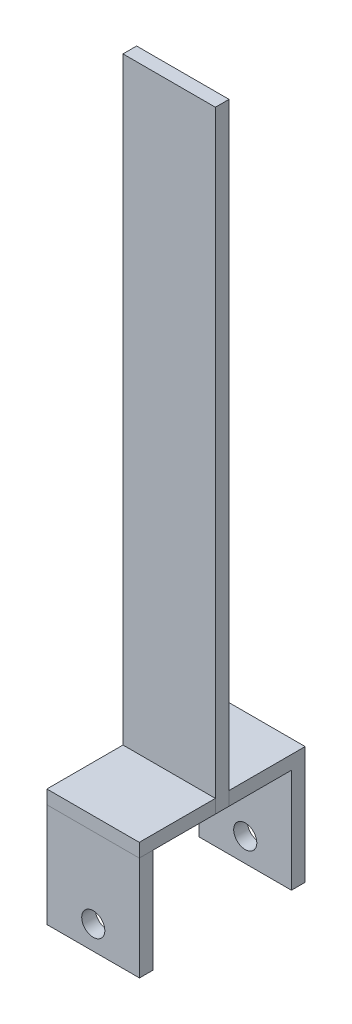
ISO-10303-21;
HEADER;
FILE_DESCRIPTION(('STEP AP214'),'2;1');
FILE_NAME('part.step','',(''),(''),'','','');
FILE_SCHEMA(('AUTOMOTIVE_DESIGN { 1 0 10303 214 1 1 1 1 }'));
ENDSEC;
DATA;
#1=APPLICATION_CONTEXT('core data for automotive mechanical design processes');
#2=APPLICATION_PROTOCOL_DEFINITION('international standard','automotive_design',2000,#1);
#3=PRODUCT_CONTEXT('',#1,'mechanical');
#4=PRODUCT('Part','Part','',(#3));
#5=PRODUCT_RELATED_PRODUCT_CATEGORY('part','',(#4));
#6=PRODUCT_DEFINITION_FORMATION('','',#4);
#7=PRODUCT_DEFINITION_CONTEXT('part definition',#1,'design');
#8=PRODUCT_DEFINITION('design','',#6,#7);
#9=PRODUCT_DEFINITION_SHAPE('','',#8);
#10=(LENGTH_UNIT() NAMED_UNIT(*) SI_UNIT(.MILLI.,.METRE.));
#11=(NAMED_UNIT(*) PLANE_ANGLE_UNIT() SI_UNIT($,.RADIAN.));
#12=(NAMED_UNIT(*) SI_UNIT($,.STERADIAN.) SOLID_ANGLE_UNIT());
#13=UNCERTAINTY_MEASURE_WITH_UNIT(LENGTH_MEASURE(1.E-05),#10,'distance_accuracy_value','');
#14=(GEOMETRIC_REPRESENTATION_CONTEXT(3) GLOBAL_UNCERTAINTY_ASSIGNED_CONTEXT((#13)) GLOBAL_UNIT_ASSIGNED_CONTEXT((#10,
#11,#12)) REPRESENTATION_CONTEXT('',''));
#15=CARTESIAN_POINT('',(0.,0.,0.));
#16=DIRECTION('',(0.,0.,1.));
#17=DIRECTION('',(1.,0.,0.));
#18=AXIS2_PLACEMENT_3D('',#15,#16,#17);
#19=CARTESIAN_POINT('',(8.48107175925922,-67.31,2.999994));
#20=DIRECTION('',(0.,1.,0.));
#21=DIRECTION('',(0.,0.,1.));
#22=AXIS2_PLACEMENT_3D('',#19,#20,#21);
#23=PLANE('',#22);
#24=DIRECTION('',(1.,0.,0.));
#25=VECTOR('',#24,1.);
#26=CARTESIAN_POINT('',(-11.8366059287919,-67.31,16.6772484590779));
#27=LINE('',#26,#25);
#28=CARTESIAN_POINT('',(-11.8366059287919,-67.31,16.6772484590779));
#29=VERTEX_POINT('',#28);
#30=CARTESIAN_POINT('',(8.48064584867505,-67.31,16.6772484590778));
#31=VERTEX_POINT('',#30);
#32=EDGE_CURVE('E48',#29,#31,#27,.T.);
#33=ORIENTED_EDGE('',*,*,#32,.F.);
#34=DIRECTION('',(0.000139125287994658,0.,-0.999999990322077));
#35=VECTOR('',#34,1.);
#36=CARTESIAN_POINT('',(-11.8370253887568,-67.31,19.6922284590778));
#37=LINE('',#36,#35);
#38=CARTESIAN_POINT('',(-11.8370253887568,-67.31,19.6922284590778));
#39=VERTEX_POINT('',#38);
#40=EDGE_CURVE('E165',#39,#29,#37,.T.);
#41=ORIENTED_EDGE('',*,*,#40,.F.);
#42=DIRECTION('',(-1.,0.,0.));
#43=VECTOR('',#42,1.);
#44=CARTESIAN_POINT('',(8.4810653086399,-67.31,19.6922284590778));
#45=LINE('',#44,#43);
#46=CARTESIAN_POINT('',(8.4810653086399,-67.31,19.6922284590778));
#47=VERTEX_POINT('',#46);
#48=EDGE_CURVE('E293',#47,#39,#45,.T.);
#49=ORIENTED_EDGE('',*,*,#48,.F.);
#50=DIRECTION('',(-0.000139125287993163,0.,-0.999999990322077));
#51=VECTOR('',#50,1.);
#52=CARTESIAN_POINT('',(8.47874299669106,-67.31,2.999994));
#53=LINE('',#52,#51);
#54=CARTESIAN_POINT('',(8.4810717592592,-67.31,19.738594));
#55=VERTEX_POINT('',#54);
#56=EDGE_CURVE('E209',#55,#47,#53,.T.);
#57=ORIENTED_EDGE('',*,*,#56,.F.);
#58=DIRECTION('',(1.,0.,0.));
#59=VECTOR('',#58,1.);
#60=CARTESIAN_POINT('',(8.4810717592592,-67.31,19.738594));
#61=LINE('',#60,#59);
#62=CARTESIAN_POINT('',(-11.8389282407408,-67.31,19.738594));
#63=VERTEX_POINT('',#62);
#64=EDGE_CURVE('E192',#63,#55,#61,.T.);
#65=ORIENTED_EDGE('',*,*,#64,.F.);
#66=DIRECTION('',(0.,0.,-1.));
#67=VECTOR('',#66,1.);
#68=CARTESIAN_POINT('',(-11.8389282407408,-67.31,2.999994));
#69=LINE('',#68,#67);
#70=CARTESIAN_POINT('',(-11.8389282407408,-67.31,-13.72362));
#71=VERTEX_POINT('',#70);
#72=EDGE_CURVE('E240',#63,#71,#69,.T.);
#73=ORIENTED_EDGE('',*,*,#72,.T.);
#74=DIRECTION('',(-1.,0.,0.));
#75=VECTOR('',#74,1.);
#76=CARTESIAN_POINT('',(-11.8389282407408,-67.31,-13.72362));
#77=LINE('',#76,#75);
#78=CARTESIAN_POINT('',(8.47916245665591,-67.31,-13.72362));
#79=VERTEX_POINT('',#78);
#80=EDGE_CURVE('E56',#79,#71,#77,.T.);
#81=ORIENTED_EDGE('',*,*,#80,.F.);
#82=DIRECTION('',(-0.000139125287993163,0.,-0.999999990322077));
#83=VECTOR('',#82,1.);
#84=CARTESIAN_POINT('',(8.47874299669106,-67.31,-16.7386));
#85=LINE('',#84,#83);
#86=CARTESIAN_POINT('',(8.48107175925922,-67.31,0.));
#87=VERTEX_POINT('',#86);
#88=EDGE_CURVE('E212',#87,#79,#85,.T.);
#89=ORIENTED_EDGE('',*,*,#88,.F.);
#90=DIRECTION('',(0.,0.,-1.));
#91=VECTOR('',#90,1.);
#92=CARTESIAN_POINT('',(8.48107175925922,-67.31,2.999994));
#93=LINE('',#92,#91);
#94=CARTESIAN_POINT('',(8.48107175925922,-67.31,2.999994));
#95=VERTEX_POINT('',#94);
#96=EDGE_CURVE('E41',#95,#87,#93,.T.);
#97=ORIENTED_EDGE('',*,*,#96,.F.);
#98=DIRECTION('',(1.,0.,0.));
#99=VECTOR('',#98,1.);
#100=CARTESIAN_POINT('',(8.48107175925922,-67.31,2.999994));
#101=LINE('',#100,#99);
#102=CARTESIAN_POINT('',(8.47874299669106,-67.31,2.999994));
#103=VERTEX_POINT('',#102);
#104=EDGE_CURVE('E231',#103,#95,#101,.T.);
#105=ORIENTED_EDGE('',*,*,#104,.F.);
#106=EDGE_CURVE('E208',#31,#103,#53,.T.);
#107=ORIENTED_EDGE('',*,*,#106,.F.);
#108=EDGE_LOOP('',(#33,#41,#49,#57,#65,#73,#81,#89,#97,#105,#107));
#109=FACE_BOUND('',#108,.T.);
#110=ADVANCED_FACE('F33',(#109),#23,.F.);
#111=CARTESIAN_POINT('',(0.,0.,2.999994));
#112=DIRECTION('',(0.,0.,-1.));
#113=DIRECTION('',(-1.,0.,0.));
#114=AXIS2_PLACEMENT_3D('',#111,#112,#113);
#115=PLANE('',#114);
#116=DIRECTION('',(0.,-1.,0.));
#117=VECTOR('',#116,1.);
#118=CARTESIAN_POINT('',(8.47874299669106,-64.310006,2.999994));
#119=LINE('',#118,#117);
#120=CARTESIAN_POINT('',(8.47874299669106,-64.310006,2.999994));
#121=VERTEX_POINT('',#120);
#122=EDGE_CURVE('E218',#121,#103,#119,.T.);
#123=ORIENTED_EDGE('',*,*,#122,.T.);
#124=ORIENTED_EDGE('',*,*,#104,.T.);
#125=DIRECTION('',(0.,1.,0.));
#126=VECTOR('',#125,1.);
#127=CARTESIAN_POINT('',(8.4810717592592,67.31,2.999994));
#128=LINE('',#127,#126);
#129=CARTESIAN_POINT('',(8.4810717592592,67.31,2.999994));
#130=VERTEX_POINT('',#129);
#131=EDGE_CURVE('E233',#95,#130,#128,.T.);
#132=ORIENTED_EDGE('',*,*,#131,.T.);
#133=DIRECTION('',(-1.,0.,0.));
#134=VECTOR('',#133,1.);
#135=CARTESIAN_POINT('',(-11.8389282407408,67.31,2.999994));
#136=LINE('',#135,#134);
#137=CARTESIAN_POINT('',(-11.8389282407408,67.31,2.999994));
#138=VERTEX_POINT('',#137);
#139=EDGE_CURVE('E236',#130,#138,#136,.T.);
#140=ORIENTED_EDGE('',*,*,#139,.T.);
#141=DIRECTION('',(0.,-1.,0.));
#142=VECTOR('',#141,1.);
#143=CARTESIAN_POINT('',(-11.8389282407408,-67.31,2.999994));
#144=LINE('',#143,#142);
#145=CARTESIAN_POINT('',(-11.8389282407408,-64.310006,2.999994));
#146=VERTEX_POINT('',#145);
#147=EDGE_CURVE('E238',#138,#146,#144,.T.);
#148=ORIENTED_EDGE('',*,*,#147,.T.);
#149=DIRECTION('',(-1.,0.,0.));
#150=VECTOR('',#149,1.);
#151=CARTESIAN_POINT('',(0.,-64.310006,2.999994));
#152=LINE('',#151,#150);
#153=EDGE_CURVE('E227',#121,#146,#152,.T.);
#154=ORIENTED_EDGE('',*,*,#153,.F.);
#155=EDGE_LOOP('',(#123,#124,#132,#140,#148,#154));
#156=FACE_BOUND('',#155,.T.);
#157=ADVANCED_FACE('F283',(#156),#115,.F.);
#158=CARTESIAN_POINT('',(0.,0.,0.));
#159=DIRECTION('',(0.,0.,-1.));
#160=DIRECTION('',(-1.,0.,0.));
#161=AXIS2_PLACEMENT_3D('',#158,#159,#160);
#162=PLANE('',#161);
#163=DIRECTION('',(0.,1.,0.));
#164=VECTOR('',#163,1.);
#165=CARTESIAN_POINT('',(8.4810717592592,67.31,0.));
#166=LINE('',#165,#164);
#167=CARTESIAN_POINT('',(8.4810717592592,-64.310006,0.));
#168=VERTEX_POINT('',#167);
#169=CARTESIAN_POINT('',(8.4810717592592,67.31,0.));
#170=VERTEX_POINT('',#169);
#171=EDGE_CURVE('E230',#168,#170,#166,.T.);
#172=ORIENTED_EDGE('',*,*,#171,.F.);
#173=DIRECTION('',(-1.,0.,0.));
#174=VECTOR('',#173,1.);
#175=CARTESIAN_POINT('',(0.,-64.310006,0.));
#176=LINE('',#175,#174);
#177=CARTESIAN_POINT('',(-11.8389282407408,-64.310006,0.));
#178=VERTEX_POINT('',#177);
#179=EDGE_CURVE('E11',#168,#178,#176,.T.);
#180=ORIENTED_EDGE('',*,*,#179,.T.);
#181=DIRECTION('',(0.,-1.,0.));
#182=VECTOR('',#181,1.);
#183=CARTESIAN_POINT('',(-11.8389282407408,-67.31,0.));
#184=LINE('',#183,#182);
#185=CARTESIAN_POINT('',(-11.8389282407408,67.31,0.));
#186=VERTEX_POINT('',#185);
#187=EDGE_CURVE('E234',#186,#178,#184,.T.);
#188=ORIENTED_EDGE('',*,*,#187,.F.);
#189=DIRECTION('',(-1.,0.,0.));
#190=VECTOR('',#189,1.);
#191=CARTESIAN_POINT('',(-11.8389282407408,67.31,0.));
#192=LINE('',#191,#190);
#193=EDGE_CURVE('E244',#170,#186,#192,.T.);
#194=ORIENTED_EDGE('',*,*,#193,.F.);
#195=EDGE_LOOP('',(#172,#180,#188,#194));
#196=FACE_BOUND('',#195,.T.);
#197=ADVANCED_FACE('F275',(#196),#162,.T.);
#198=CARTESIAN_POINT('',(8.4810717592592,67.31,2.999994));
#199=DIRECTION('',(-1.,0.,0.));
#200=DIRECTION('',(0.,-1.,0.));
#201=AXIS2_PLACEMENT_3D('',#198,#199,#200);
#202=PLANE('',#201);
#203=EDGE_CURVE('E241',#87,#168,#166,.T.);
#204=ORIENTED_EDGE('',*,*,#203,.T.);
#205=ORIENTED_EDGE('',*,*,#171,.T.);
#206=DIRECTION('',(0.,0.,-1.));
#207=VECTOR('',#206,1.);
#208=CARTESIAN_POINT('',(8.4810717592592,67.31,2.999994));
#209=LINE('',#208,#207);
#210=EDGE_CURVE('E252',#130,#170,#209,.T.);
#211=ORIENTED_EDGE('',*,*,#210,.F.);
#212=ORIENTED_EDGE('',*,*,#131,.F.);
#213=ORIENTED_EDGE('',*,*,#96,.T.);
#214=EDGE_LOOP('',(#204,#205,#211,#212,#213));
#215=FACE_BOUND('',#214,.T.);
#216=ADVANCED_FACE('F259',(#215),#202,.F.);
#217=CARTESIAN_POINT('',(-11.8389282407408,67.31,2.999994));
#218=DIRECTION('',(0.,-1.,0.));
#219=DIRECTION('',(0.,0.,-1.));
#220=AXIS2_PLACEMENT_3D('',#217,#218,#219);
#221=PLANE('',#220);
#222=ORIENTED_EDGE('',*,*,#193,.T.);
#223=DIRECTION('',(0.,0.,-1.));
#224=VECTOR('',#223,1.);
#225=CARTESIAN_POINT('',(-11.8389282407408,67.31,2.999994));
#226=LINE('',#225,#224);
#227=EDGE_CURVE('E249',#138,#186,#226,.T.);
#228=ORIENTED_EDGE('',*,*,#227,.F.);
#229=ORIENTED_EDGE('',*,*,#139,.F.);
#230=ORIENTED_EDGE('',*,*,#210,.T.);
#231=EDGE_LOOP('',(#222,#228,#229,#230));
#232=FACE_BOUND('',#231,.T.);
#233=ADVANCED_FACE('F279',(#232),#221,.F.);
#234=CARTESIAN_POINT('',(-11.8389282407408,-67.31,2.999994));
#235=DIRECTION('',(1.,0.,0.));
#236=DIRECTION('',(0.,0.,-1.));
#237=AXIS2_PLACEMENT_3D('',#234,#235,#236);
#238=PLANE('',#237);
#239=ORIENTED_EDGE('',*,*,#72,.F.);
#240=DIRECTION('',(0.,-1.,0.));
#241=VECTOR('',#240,1.);
#242=CARTESIAN_POINT('',(-11.8389282407408,-64.310006,19.738594));
#243=LINE('',#242,#241);
#244=CARTESIAN_POINT('',(-11.8389282407408,-64.310006,19.738594));
#245=VERTEX_POINT('',#244);
#246=EDGE_CURVE('E224',#245,#63,#243,.T.);
#247=ORIENTED_EDGE('',*,*,#246,.F.);
#248=DIRECTION('',(0.,0.,1.));
#249=VECTOR('',#248,1.);
#250=CARTESIAN_POINT('',(-11.8389282407408,-64.310006,0.));
#251=LINE('',#250,#249);
#252=EDGE_CURVE('E196',#146,#245,#251,.T.);
#253=ORIENTED_EDGE('',*,*,#252,.F.);
#254=ORIENTED_EDGE('',*,*,#147,.F.);
#255=ORIENTED_EDGE('',*,*,#227,.T.);
#256=ORIENTED_EDGE('',*,*,#187,.T.);
#257=CARTESIAN_POINT('',(-11.8389282407408,-64.310006,-16.7386));
#258=VERTEX_POINT('',#257);
#259=EDGE_CURVE('E193',#258,#178,#251,.T.);
#260=ORIENTED_EDGE('',*,*,#259,.F.);
#261=DIRECTION('',(0.,-1.,0.));
#262=VECTOR('',#261,1.);
#263=CARTESIAN_POINT('',(-11.8389282407408,-64.310006,-16.7386));
#264=LINE('',#263,#262);
#265=CARTESIAN_POINT('',(-11.8389282407408,-90.17,-16.7386));
#266=VERTEX_POINT('',#265);
#267=EDGE_CURVE('E206',#258,#266,#264,.T.);
#268=ORIENTED_EDGE('',*,*,#267,.T.);
#269=DIRECTION('',(0.,0.,-1.));
#270=VECTOR('',#269,1.);
#271=CARTESIAN_POINT('',(-11.8389282407408,-90.17,-16.7386));
#272=LINE('',#271,#270);
#273=CARTESIAN_POINT('',(-11.8389282407408,-90.17,-13.72362));
#274=VERTEX_POINT('',#273);
#275=EDGE_CURVE('E183',#274,#266,#272,.T.);
#276=ORIENTED_EDGE('',*,*,#275,.F.);
#277=DIRECTION('',(0.,1.,0.));
#278=VECTOR('',#277,1.);
#279=CARTESIAN_POINT('',(-11.8389282407408,-90.17,-13.72362));
#280=LINE('',#279,#278);
#281=EDGE_CURVE('E185',#274,#71,#280,.T.);
#282=ORIENTED_EDGE('',*,*,#281,.T.);
#283=EDGE_LOOP('',(#239,#247,#253,#254,#255,#256,#260,#268,#276,#282));
#284=FACE_BOUND('',#283,.T.);
#285=ADVANCED_FACE('F321',(#284),#238,.F.);
#286=CARTESIAN_POINT('',(-11.8389282407408,-64.310006,-16.7386));
#287=DIRECTION('',(0.,0.,1.));
#288=DIRECTION('',(1.,0.,0.));
#289=AXIS2_PLACEMENT_3D('',#286,#287,#288);
#290=PLANE('',#289);
#291=CARTESIAN_POINT('',(-1.68009262202486,-84.961272754422,-16.7386));
#292=DIRECTION('',(0.,0.,-1.));
#293=DIRECTION('',(-1.,0.,0.));
#294=AXIS2_PLACEMENT_3D('',#291,#292,#293);
#295=CIRCLE('',#294,2.54);
#296=CARTESIAN_POINT('',(-4.22009262202486,-84.961272754422,-16.7386));
#297=VERTEX_POINT('',#296);
#298=EDGE_CURVE('E482',#297,#297,#295,.T.);
#299=ORIENTED_EDGE('',*,*,#298,.F.);
#300=EDGE_LOOP('',(#299));
#301=FACE_BOUND('',#300,.T.);
#302=DIRECTION('',(0.,-1.,0.));
#303=VECTOR('',#302,1.);
#304=CARTESIAN_POINT('',(8.47874299669106,-64.310006,-16.7386));
#305=LINE('',#304,#303);
#306=CARTESIAN_POINT('',(8.47874299669106,-64.310006,-16.7386));
#307=VERTEX_POINT('',#306);
#308=CARTESIAN_POINT('',(8.47874299669106,-90.17,-16.7386));
#309=VERTEX_POINT('',#308);
#310=EDGE_CURVE('E216',#307,#309,#305,.T.);
#311=ORIENTED_EDGE('',*,*,#310,.T.);
#312=DIRECTION('',(1.,0.,0.));
#313=VECTOR('',#312,1.);
#314=CARTESIAN_POINT('',(8.47874299669106,-90.17,-16.7386));
#315=LINE('',#314,#313);
#316=EDGE_CURVE('E171',#266,#309,#315,.T.);
#317=ORIENTED_EDGE('',*,*,#316,.F.);
#318=ORIENTED_EDGE('',*,*,#267,.F.);
#319=DIRECTION('',(-1.,0.,0.));
#320=VECTOR('',#319,1.);
#321=CARTESIAN_POINT('',(-11.8389282407408,-64.310006,-16.7386));
#322=LINE('',#321,#320);
#323=EDGE_CURVE('E203',#307,#258,#322,.T.);
#324=ORIENTED_EDGE('',*,*,#323,.F.);
#325=EDGE_LOOP('',(#311,#317,#318,#324));
#326=FACE_BOUND('',#325,.T.);
#327=ADVANCED_FACE('F327',(#301,#326),#290,.F.);
#328=CARTESIAN_POINT('',(0.,-64.310006,0.));
#329=DIRECTION('',(0.,-1.,0.));
#330=DIRECTION('',(0.,0.,-1.));
#331=AXIS2_PLACEMENT_3D('',#328,#329,#330);
#332=PLANE('',#331);
#333=ORIENTED_EDGE('',*,*,#179,.F.);
#334=DIRECTION('',(-0.000139125287993163,0.,-0.999999990322077));
#335=VECTOR('',#334,1.);
#336=CARTESIAN_POINT('',(8.47874299669106,-64.310006,-16.7386));
#337=LINE('',#336,#335);
#338=EDGE_CURVE('E201',#168,#307,#337,.T.);
#339=ORIENTED_EDGE('',*,*,#338,.T.);
#340=ORIENTED_EDGE('',*,*,#323,.T.);
#341=ORIENTED_EDGE('',*,*,#259,.T.);
#342=EDGE_LOOP('',(#333,#339,#340,#341));
#343=FACE_BOUND('',#342,.T.);
#344=ADVANCED_FACE('F328',(#343),#332,.F.);
#345=CARTESIAN_POINT('',(8.47874299669106,-64.310006,-16.7386));
#346=DIRECTION('',(-0.999999990322077,0.,0.000139125287993163));
#347=DIRECTION('',(0.000139125287993163,0.,0.999999990322077));
#348=AXIS2_PLACEMENT_3D('',#345,#346,#347);
#349=PLANE('',#348);
#350=ORIENTED_EDGE('',*,*,#88,.T.);
#351=DIRECTION('',(0.,1.,0.));
#352=VECTOR('',#351,1.);
#353=CARTESIAN_POINT('',(8.47916245665592,-90.17,-13.72362));
#354=LINE('',#353,#352);
#355=CARTESIAN_POINT('',(8.47916245665592,-90.17,-13.72362));
#356=VERTEX_POINT('',#355);
#357=EDGE_CURVE('E189',#356,#79,#354,.T.);
#358=ORIENTED_EDGE('',*,*,#357,.F.);
#359=DIRECTION('',(0.000139125287993507,0.,0.999999990322077));
#360=VECTOR('',#359,1.);
#361=CARTESIAN_POINT('',(8.47916245665592,-90.17,-13.72362));
#362=LINE('',#361,#360);
#363=EDGE_CURVE('E179',#309,#356,#362,.T.);
#364=ORIENTED_EDGE('',*,*,#363,.F.);
#365=ORIENTED_EDGE('',*,*,#310,.F.);
#366=ORIENTED_EDGE('',*,*,#338,.F.);
#367=ORIENTED_EDGE('',*,*,#203,.F.);
#368=EDGE_LOOP('',(#350,#358,#364,#365,#366,#367));
#369=FACE_BOUND('',#368,.T.);
#370=ADVANCED_FACE('F267',(#369),#349,.F.);
#371=DIRECTION('',(-0.000139125287993163,0.,-0.999999990322077));
#372=VECTOR('',#371,1.);
#373=CARTESIAN_POINT('',(8.47874299669106,-64.310006,2.999994));
#374=LINE('',#373,#372);
#375=CARTESIAN_POINT('',(8.4810717592592,-64.310006,19.738594));
#376=VERTEX_POINT('',#375);
#377=EDGE_CURVE('E198',#376,#121,#374,.T.);
#378=ORIENTED_EDGE('',*,*,#377,.T.);
#379=ORIENTED_EDGE('',*,*,#153,.T.);
#380=ORIENTED_EDGE('',*,*,#252,.T.);
#381=DIRECTION('',(1.,0.,0.));
#382=VECTOR('',#381,1.);
#383=CARTESIAN_POINT('',(8.4810717592592,-64.310006,19.738594));
#384=LINE('',#383,#382);
#385=EDGE_CURVE('E195',#245,#376,#384,.T.);
#386=ORIENTED_EDGE('',*,*,#385,.T.);
#387=EDGE_LOOP('',(#378,#379,#380,#386));
#388=FACE_BOUND('',#387,.T.);
#389=ADVANCED_FACE('F331',(#388),#332,.F.);
#390=CARTESIAN_POINT('',(8.4810717592592,-64.310006,19.738594));
#391=DIRECTION('',(0.,0.,-1.));
#392=DIRECTION('',(-1.,0.,0.));
#393=AXIS2_PLACEMENT_3D('',#390,#391,#392);
#394=PLANE('',#393);
#395=ORIENTED_EDGE('',*,*,#64,.T.);
#396=DIRECTION('',(0.,-1.,0.));
#397=VECTOR('',#396,1.);
#398=CARTESIAN_POINT('',(8.4810717592592,-64.310006,19.738594));
#399=LINE('',#398,#397);
#400=EDGE_CURVE('E221',#376,#55,#399,.T.);
#401=ORIENTED_EDGE('',*,*,#400,.F.);
#402=ORIENTED_EDGE('',*,*,#385,.F.);
#403=ORIENTED_EDGE('',*,*,#246,.T.);
#404=EDGE_LOOP('',(#395,#401,#402,#403));
#405=FACE_BOUND('',#404,.T.);
#406=ADVANCED_FACE('F313',(#405),#394,.F.);
#407=CARTESIAN_POINT('',(8.47874299669106,-64.310006,2.999994));
#408=DIRECTION('',(-0.999999990322077,0.,0.000139125287993163));
#409=DIRECTION('',(0.000139125287993163,0.,0.999999990322077));
#410=AXIS2_PLACEMENT_3D('',#407,#408,#409);
#411=PLANE('',#410);
#412=ORIENTED_EDGE('',*,*,#56,.T.);
#413=EDGE_CURVE('E213',#47,#31,#53,.T.);
#414=ORIENTED_EDGE('',*,*,#413,.T.);
#415=ORIENTED_EDGE('',*,*,#106,.T.);
#416=ORIENTED_EDGE('',*,*,#122,.F.);
#417=ORIENTED_EDGE('',*,*,#377,.F.);
#418=ORIENTED_EDGE('',*,*,#400,.T.);
#419=EDGE_LOOP('',(#412,#414,#415,#416,#417,#418));
#420=FACE_BOUND('',#419,.T.);
#421=ADVANCED_FACE('F287',(#420),#411,.F.);
#422=CARTESIAN_POINT('',(-11.8389282407408,-90.17,-13.72362));
#423=DIRECTION('',(0.,0.,-1.));
#424=DIRECTION('',(-1.,0.,0.));
#425=AXIS2_PLACEMENT_3D('',#422,#423,#424);
#426=PLANE('',#425);
#427=CARTESIAN_POINT('',(-1.68009262202486,-84.961272754422,-13.72362));
#428=DIRECTION('',(0.,0.,-1.));
#429=DIRECTION('',(-1.,0.,0.));
#430=AXIS2_PLACEMENT_3D('',#427,#428,#429);
#431=CIRCLE('',#430,2.54);
#432=CARTESIAN_POINT('',(-4.22009262202486,-84.961272754422,-13.72362));
#433=VERTEX_POINT('',#432);
#434=EDGE_CURVE('E295',#433,#433,#431,.T.);
#435=ORIENTED_EDGE('',*,*,#434,.T.);
#436=EDGE_LOOP('',(#435));
#437=FACE_BOUND('',#436,.T.);
#438=ORIENTED_EDGE('',*,*,#80,.T.);
#439=ORIENTED_EDGE('',*,*,#281,.F.);
#440=DIRECTION('',(-1.,0.,0.));
#441=VECTOR('',#440,1.);
#442=CARTESIAN_POINT('',(-11.8389282407408,-90.17,-13.72362));
#443=LINE('',#442,#441);
#444=EDGE_CURVE('E181',#356,#274,#443,.T.);
#445=ORIENTED_EDGE('',*,*,#444,.F.);
#446=ORIENTED_EDGE('',*,*,#357,.T.);
#447=EDGE_LOOP('',(#438,#439,#445,#446));
#448=FACE_BOUND('',#447,.T.);
#449=ADVANCED_FACE('F318',(#437,#448),#426,.F.);
#450=CARTESIAN_POINT('',(0.,-90.17,0.));
#451=DIRECTION('',(0.,1.,0.));
#452=DIRECTION('',(0.,0.,1.));
#453=AXIS2_PLACEMENT_3D('',#450,#451,#452);
#454=PLANE('',#453);
#455=ORIENTED_EDGE('',*,*,#316,.T.);
#456=ORIENTED_EDGE('',*,*,#363,.T.);
#457=ORIENTED_EDGE('',*,*,#444,.T.);
#458=ORIENTED_EDGE('',*,*,#275,.T.);
#459=EDGE_LOOP('',(#455,#456,#457,#458));
#460=FACE_BOUND('',#459,.T.);
#461=ADVANCED_FACE('F325',(#460),#454,.F.);
#462=CARTESIAN_POINT('',(0.,-67.31,0.));
#463=DIRECTION('',(0.,-1.,0.));
#464=DIRECTION('',(0.,0.,-1.));
#465=AXIS2_PLACEMENT_3D('',#462,#463,#464);
#466=PLANE('',#465);
#467=CARTESIAN_POINT('',(8.4810653086399,-67.31,16.6772484590779));
#468=VERTEX_POINT('',#467);
#469=EDGE_CURVE('E168',#31,#468,#27,.T.);
#470=ORIENTED_EDGE('',*,*,#469,.F.);
#471=ORIENTED_EDGE('',*,*,#413,.F.);
#472=DIRECTION('',(0.,0.,1.));
#473=VECTOR('',#472,1.);
#474=CARTESIAN_POINT('',(8.4810653086399,-67.31,16.6772484590779));
#475=LINE('',#474,#473);
#476=EDGE_CURVE('E291',#468,#47,#475,.T.);
#477=ORIENTED_EDGE('',*,*,#476,.F.);
#478=EDGE_LOOP('',(#470,#471,#477));
#479=FACE_BOUND('',#478,.T.);
#480=ADVANCED_FACE('F407',(#479),#466,.F.);
#481=CARTESIAN_POINT('',(-11.8366059287919,-90.17,16.6772484590779));
#482=DIRECTION('',(0.,0.,1.));
#483=DIRECTION('',(1.,0.,0.));
#484=AXIS2_PLACEMENT_3D('',#481,#482,#483);
#485=PLANE('',#484);
#486=CARTESIAN_POINT('',(-1.68009262202486,-84.961272754422,16.6772484590779));
#487=DIRECTION('',(0.,0.,1.));
#488=DIRECTION('',(1.,0.,0.));
#489=AXIS2_PLACEMENT_3D('',#486,#487,#488);
#490=CIRCLE('',#489,2.54);
#491=CARTESIAN_POINT('',(0.859907377975139,-84.961272754422,16.6772484590779));
#492=VERTEX_POINT('',#491);
#493=EDGE_CURVE('E477',#492,#492,#490,.T.);
#494=ORIENTED_EDGE('',*,*,#493,.T.);
#495=EDGE_LOOP('',(#494));
#496=FACE_BOUND('',#495,.T.);
#497=ORIENTED_EDGE('',*,*,#32,.T.);
#498=ORIENTED_EDGE('',*,*,#469,.T.);
#499=DIRECTION('',(0.,1.,0.));
#500=VECTOR('',#499,1.);
#501=CARTESIAN_POINT('',(8.4810653086399,-90.17,16.6772484590779));
#502=LINE('',#501,#500);
#503=CARTESIAN_POINT('',(8.4810653086399,-90.17,16.6772484590779));
#504=VERTEX_POINT('',#503);
#505=EDGE_CURVE('E152',#504,#468,#502,.T.);
#506=ORIENTED_EDGE('',*,*,#505,.F.);
#507=DIRECTION('',(1.,0.,0.));
#508=VECTOR('',#507,1.);
#509=CARTESIAN_POINT('',(-11.8366059287919,-90.17,16.6772484590779));
#510=LINE('',#509,#508);
#511=CARTESIAN_POINT('',(-11.8366059287919,-90.17,16.6772484590779));
#512=VERTEX_POINT('',#511);
#513=EDGE_CURVE('E158',#512,#504,#510,.T.);
#514=ORIENTED_EDGE('',*,*,#513,.F.);
#515=DIRECTION('',(0.,1.,0.));
#516=VECTOR('',#515,1.);
#517=CARTESIAN_POINT('',(-11.8366059287919,-90.17,16.6772484590779));
#518=LINE('',#517,#516);
#519=EDGE_CURVE('E301',#512,#29,#518,.T.);
#520=ORIENTED_EDGE('',*,*,#519,.T.);
#521=EDGE_LOOP('',(#497,#498,#506,#514,#520));
#522=FACE_BOUND('',#521,.T.);
#523=ADVANCED_FACE('F167',(#496,#522),#485,.F.);
#524=CARTESIAN_POINT('',(8.4810653086399,-90.17,16.6772484590779));
#525=DIRECTION('',(-1.,0.,0.));
#526=DIRECTION('',(0.,0.,1.));
#527=AXIS2_PLACEMENT_3D('',#524,#525,#526);
#528=PLANE('',#527);
#529=ORIENTED_EDGE('',*,*,#476,.T.);
#530=DIRECTION('',(0.,1.,0.));
#531=VECTOR('',#530,1.);
#532=CARTESIAN_POINT('',(8.4810653086399,-90.17,19.6922284590778));
#533=LINE('',#532,#531);
#534=CARTESIAN_POINT('',(8.4810653086399,-90.17,19.6922284590778));
#535=VERTEX_POINT('',#534);
#536=EDGE_CURVE('E154',#535,#47,#533,.T.);
#537=ORIENTED_EDGE('',*,*,#536,.F.);
#538=DIRECTION('',(0.,0.,1.));
#539=VECTOR('',#538,1.);
#540=CARTESIAN_POINT('',(8.4810653086399,-90.17,16.6772484590779));
#541=LINE('',#540,#539);
#542=EDGE_CURVE('E147',#504,#535,#541,.T.);
#543=ORIENTED_EDGE('',*,*,#542,.F.);
#544=ORIENTED_EDGE('',*,*,#505,.T.);
#545=EDGE_LOOP('',(#529,#537,#543,#544));
#546=FACE_BOUND('',#545,.T.);
#547=ADVANCED_FACE('F150',(#546),#528,.F.);
#548=CARTESIAN_POINT('',(8.4810653086399,-90.17,19.6922284590778));
#549=DIRECTION('',(0.,0.,-1.));
#550=DIRECTION('',(-1.,0.,0.));
#551=AXIS2_PLACEMENT_3D('',#548,#549,#550);
#552=PLANE('',#551);
#553=CARTESIAN_POINT('',(-1.68009262202486,-84.961272754422,19.6922284590778));
#554=DIRECTION('',(0.,0.,-1.));
#555=DIRECTION('',(-1.,0.,0.));
#556=AXIS2_PLACEMENT_3D('',#553,#554,#555);
#557=CIRCLE('',#556,2.54);
#558=CARTESIAN_POINT('',(-4.22009262202486,-84.961272754422,19.6922284590778));
#559=VERTEX_POINT('',#558);
#560=EDGE_CURVE('E36',#559,#559,#557,.T.);
#561=ORIENTED_EDGE('',*,*,#560,.T.);
#562=EDGE_LOOP('',(#561));
#563=FACE_BOUND('',#562,.T.);
#564=ORIENTED_EDGE('',*,*,#48,.T.);
#565=DIRECTION('',(0.,1.,0.));
#566=VECTOR('',#565,1.);
#567=CARTESIAN_POINT('',(-11.8370253887568,-90.17,19.6922284590778));
#568=LINE('',#567,#566);
#569=CARTESIAN_POINT('',(-11.8370253887568,-90.17,19.6922284590778));
#570=VERTEX_POINT('',#569);
#571=EDGE_CURVE('E173',#570,#39,#568,.T.);
#572=ORIENTED_EDGE('',*,*,#571,.F.);
#573=DIRECTION('',(-1.,0.,0.));
#574=VECTOR('',#573,1.);
#575=CARTESIAN_POINT('',(8.4810653086399,-90.17,19.6922284590778));
#576=LINE('',#575,#574);
#577=EDGE_CURVE('E157',#535,#570,#576,.T.);
#578=ORIENTED_EDGE('',*,*,#577,.F.);
#579=ORIENTED_EDGE('',*,*,#536,.T.);
#580=EDGE_LOOP('',(#564,#572,#578,#579));
#581=FACE_BOUND('',#580,.T.);
#582=ADVANCED_FACE('F307',(#563,#581),#552,.F.);
#583=CARTESIAN_POINT('',(-11.8370253887568,-90.17,19.6922284590778));
#584=DIRECTION('',(0.999999990322077,0.,0.000139125287994658));
#585=DIRECTION('',(0.000139125287994658,0.,-0.999999990322077));
#586=AXIS2_PLACEMENT_3D('',#583,#584,#585);
#587=PLANE('',#586);
#588=ORIENTED_EDGE('',*,*,#40,.T.);
#589=ORIENTED_EDGE('',*,*,#519,.F.);
#590=DIRECTION('',(0.000139125287994658,0.,-0.999999990322077));
#591=VECTOR('',#590,1.);
#592=CARTESIAN_POINT('',(-11.8370253887568,-90.17,19.6922284590778));
#593=LINE('',#592,#591);
#594=EDGE_CURVE('E163',#570,#512,#593,.T.);
#595=ORIENTED_EDGE('',*,*,#594,.F.);
#596=ORIENTED_EDGE('',*,*,#571,.T.);
#597=EDGE_LOOP('',(#588,#589,#595,#596));
#598=FACE_BOUND('',#597,.T.);
#599=ADVANCED_FACE('F305',(#598),#587,.F.);
#600=CARTESIAN_POINT('',(0.,-90.17,0.));
#601=DIRECTION('',(0.,-1.,0.));
#602=DIRECTION('',(0.,0.,-1.));
#603=AXIS2_PLACEMENT_3D('',#600,#601,#602);
#604=PLANE('',#603);
#605=ORIENTED_EDGE('',*,*,#513,.T.);
#606=ORIENTED_EDGE('',*,*,#542,.T.);
#607=ORIENTED_EDGE('',*,*,#577,.T.);
#608=ORIENTED_EDGE('',*,*,#594,.T.);
#609=EDGE_LOOP('',(#605,#606,#607,#608));
#610=FACE_BOUND('',#609,.T.);
#611=ADVANCED_FACE('F161',(#610),#604,.T.);
#612=CARTESIAN_POINT('',(-1.68009262202486,-84.961272754422,19.738594));
#613=DIRECTION('',(0.,0.,-1.));
#614=DIRECTION('',(-1.,0.,0.));
#615=AXIS2_PLACEMENT_3D('',#612,#613,#614);
#616=CYLINDRICAL_SURFACE('',#615,2.54);
#617=ORIENTED_EDGE('',*,*,#560,.F.);
#618=EDGE_LOOP('',(#617));
#619=FACE_BOUND('',#618,.T.);
#620=ORIENTED_EDGE('',*,*,#493,.F.);
#621=EDGE_LOOP('',(#620));
#622=FACE_BOUND('',#621,.T.);
#623=ADVANCED_FACE('F443',(#619,#622),#616,.F.);
#624=ORIENTED_EDGE('',*,*,#298,.T.);
#625=EDGE_LOOP('',(#624));
#626=FACE_BOUND('',#625,.T.);
#627=ORIENTED_EDGE('',*,*,#434,.F.);
#628=EDGE_LOOP('',(#627));
#629=FACE_BOUND('',#628,.T.);
#630=ADVANCED_FACE('F453',(#626,#629),#616,.F.);
#631=CLOSED_SHELL('',(#110,#157,#197,#216,#233,#285,#327,#344,#370,#389,#406,#421,#449,#461,
#480,#523,#547,#582,#599,#611,#623,#630));
#632=MANIFOLD_SOLID_BREP('B2',#631);
#633=ADVANCED_BREP_SHAPE_REPRESENTATION('',(#18,#632),#14);
#634=SHAPE_DEFINITION_REPRESENTATION(#9,#633);
ENDSEC;
END-ISO-10303-21;
